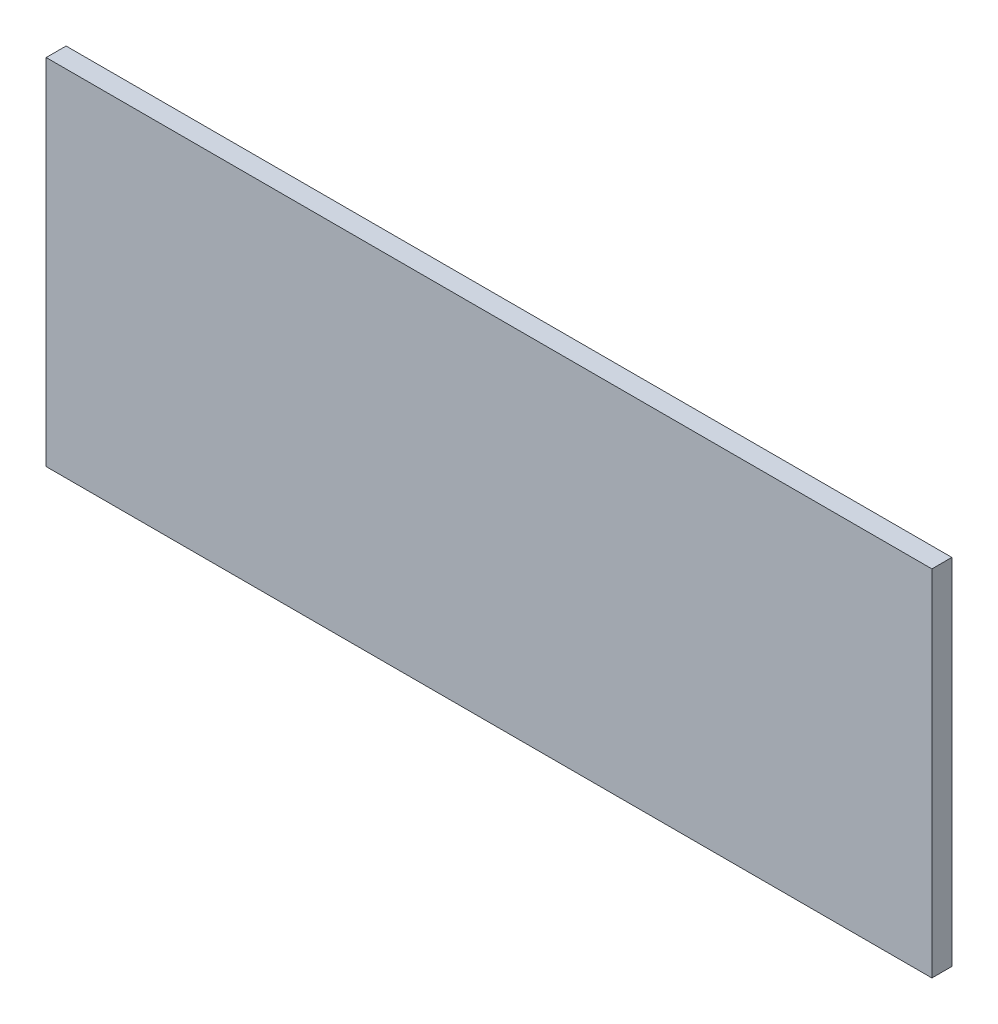
ISO-10303-21;
HEADER;
FILE_DESCRIPTION(('STEP AP214'),'2;1');
FILE_NAME('part.step','',(''),(''),'','','');
FILE_SCHEMA(('AUTOMOTIVE_DESIGN { 1 0 10303 214 1 1 1 1 }'));
ENDSEC;
DATA;
#1=APPLICATION_CONTEXT('core data for automotive mechanical design processes');
#2=APPLICATION_PROTOCOL_DEFINITION('international standard','automotive_design',2000,#1);
#3=PRODUCT_CONTEXT('',#1,'mechanical');
#4=PRODUCT('Part','Part','',(#3));
#5=PRODUCT_RELATED_PRODUCT_CATEGORY('part','',(#4));
#6=PRODUCT_DEFINITION_FORMATION('','',#4);
#7=PRODUCT_DEFINITION_CONTEXT('part definition',#1,'design');
#8=PRODUCT_DEFINITION('design','',#6,#7);
#9=PRODUCT_DEFINITION_SHAPE('','',#8);
#10=(LENGTH_UNIT() NAMED_UNIT(*) SI_UNIT(.MILLI.,.METRE.));
#11=(NAMED_UNIT(*) PLANE_ANGLE_UNIT() SI_UNIT($,.RADIAN.));
#12=(NAMED_UNIT(*) SI_UNIT($,.STERADIAN.) SOLID_ANGLE_UNIT());
#13=UNCERTAINTY_MEASURE_WITH_UNIT(LENGTH_MEASURE(1.E-05),#10,'distance_accuracy_value','');
#14=(GEOMETRIC_REPRESENTATION_CONTEXT(3) GLOBAL_UNCERTAINTY_ASSIGNED_CONTEXT((#13)) GLOBAL_UNIT_ASSIGNED_CONTEXT((#10,
#11,#12)) REPRESENTATION_CONTEXT('',''));
#15=CARTESIAN_POINT('',(0.,0.,0.));
#16=DIRECTION('',(0.,0.,1.));
#17=DIRECTION('',(1.,0.,0.));
#18=AXIS2_PLACEMENT_3D('',#15,#16,#17);
#19=CARTESIAN_POINT('',(-25.4,8.89,1.));
#20=DIRECTION('',(0.,0.,1.));
#21=DIRECTION('',(1.,0.,0.));
#22=AXIS2_PLACEMENT_3D('',#19,#20,#21);
#23=PLANE('',#22);
#24=DIRECTION('',(0.,1.,0.));
#25=VECTOR('',#24,1.);
#26=CARTESIAN_POINT('',(19.05,8.89,1.));
#27=LINE('',#26,#25);
#28=CARTESIAN_POINT('',(19.05,8.89,1.));
#29=VERTEX_POINT('',#28);
#30=CARTESIAN_POINT('',(19.05,-8.89,1.));
#31=VERTEX_POINT('',#30);
#32=EDGE_CURVE('E53',#29,#31,#27,.F.);
#33=ORIENTED_EDGE('',*,*,#32,.F.);
#34=DIRECTION('',(1.,0.,0.));
#35=VECTOR('',#34,1.);
#36=CARTESIAN_POINT('',(-25.4,8.89,1.));
#37=LINE('',#36,#35);
#38=CARTESIAN_POINT('',(-25.4,8.89,1.));
#39=VERTEX_POINT('',#38);
#40=EDGE_CURVE('E68',#39,#29,#37,.T.);
#41=ORIENTED_EDGE('',*,*,#40,.F.);
#42=DIRECTION('',(0.,1.,0.));
#43=VECTOR('',#42,1.);
#44=CARTESIAN_POINT('',(-25.4,-8.89,1.));
#45=LINE('',#44,#43);
#46=CARTESIAN_POINT('',(-25.4,-8.89,1.));
#47=VERTEX_POINT('',#46);
#48=EDGE_CURVE('E20',#47,#39,#45,.T.);
#49=ORIENTED_EDGE('',*,*,#48,.F.);
#50=DIRECTION('',(1.,0.,0.));
#51=VECTOR('',#50,1.);
#52=CARTESIAN_POINT('',(19.05,-8.89,1.));
#53=LINE('',#52,#51);
#54=EDGE_CURVE('E58',#31,#47,#53,.F.);
#55=ORIENTED_EDGE('',*,*,#54,.F.);
#56=EDGE_LOOP('',(#33,#41,#49,#55));
#57=FACE_BOUND('',#56,.T.);
#58=ADVANCED_FACE('F17',(#57),#23,.T.);
#59=CARTESIAN_POINT('',(-25.4,-8.89,0.));
#60=DIRECTION('',(-1.,0.,0.));
#61=DIRECTION('',(0.,0.,1.));
#62=AXIS2_PLACEMENT_3D('',#59,#60,#61);
#63=PLANE('',#62);
#64=DIRECTION('',(0.,0.,1.));
#65=VECTOR('',#64,1.);
#66=CARTESIAN_POINT('',(-25.4,8.89,0.));
#67=LINE('',#66,#65);
#68=CARTESIAN_POINT('',(-25.4,8.89,0.));
#69=VERTEX_POINT('',#68);
#70=EDGE_CURVE('E79',#69,#39,#67,.T.);
#71=ORIENTED_EDGE('',*,*,#70,.F.);
#72=DIRECTION('',(0.,1.,0.));
#73=VECTOR('',#72,1.);
#74=CARTESIAN_POINT('',(-25.4,8.89,0.));
#75=LINE('',#74,#73);
#76=CARTESIAN_POINT('',(-25.4,-8.89,0.));
#77=VERTEX_POINT('',#76);
#78=EDGE_CURVE('E74',#69,#77,#75,.F.);
#79=ORIENTED_EDGE('',*,*,#78,.T.);
#80=DIRECTION('',(0.,0.,-1.));
#81=VECTOR('',#80,1.);
#82=CARTESIAN_POINT('',(-25.4,-8.89,0.));
#83=LINE('',#82,#81);
#84=EDGE_CURVE('E63',#47,#77,#83,.T.);
#85=ORIENTED_EDGE('',*,*,#84,.F.);
#86=ORIENTED_EDGE('',*,*,#48,.T.);
#87=EDGE_LOOP('',(#71,#79,#85,#86));
#88=FACE_BOUND('',#87,.T.);
#89=ADVANCED_FACE('F73',(#88),#63,.T.);
#90=CARTESIAN_POINT('',(19.05,-8.89,0.));
#91=DIRECTION('',(0.,-1.,0.));
#92=DIRECTION('',(0.,0.,-1.));
#93=AXIS2_PLACEMENT_3D('',#90,#91,#92);
#94=PLANE('',#93);
#95=ORIENTED_EDGE('',*,*,#84,.T.);
#96=DIRECTION('',(1.,0.,0.));
#97=VECTOR('',#96,1.);
#98=CARTESIAN_POINT('',(-25.4,-8.89,0.));
#99=LINE('',#98,#97);
#100=CARTESIAN_POINT('',(19.05,-8.89,0.));
#101=VERTEX_POINT('',#100);
#102=EDGE_CURVE('E84',#77,#101,#99,.T.);
#103=ORIENTED_EDGE('',*,*,#102,.T.);
#104=DIRECTION('',(0.,0.,-1.));
#105=VECTOR('',#104,1.);
#106=CARTESIAN_POINT('',(19.05,-8.89,0.));
#107=LINE('',#106,#105);
#108=EDGE_CURVE('E65',#31,#101,#107,.T.);
#109=ORIENTED_EDGE('',*,*,#108,.F.);
#110=ORIENTED_EDGE('',*,*,#54,.T.);
#111=EDGE_LOOP('',(#95,#103,#109,#110));
#112=FACE_BOUND('',#111,.T.);
#113=ADVANCED_FACE('F60',(#112),#94,.T.);
#114=CARTESIAN_POINT('',(19.05,8.89,0.));
#115=DIRECTION('',(1.,0.,0.));
#116=DIRECTION('',(0.,0.,-1.));
#117=AXIS2_PLACEMENT_3D('',#114,#115,#116);
#118=PLANE('',#117);
#119=ORIENTED_EDGE('',*,*,#108,.T.);
#120=DIRECTION('',(0.,1.,0.));
#121=VECTOR('',#120,1.);
#122=CARTESIAN_POINT('',(19.05,8.89,0.));
#123=LINE('',#122,#121);
#124=CARTESIAN_POINT('',(19.05,8.89,0.));
#125=VERTEX_POINT('',#124);
#126=EDGE_CURVE('E26',#101,#125,#123,.T.);
#127=ORIENTED_EDGE('',*,*,#126,.T.);
#128=DIRECTION('',(0.,0.,1.));
#129=VECTOR('',#128,1.);
#130=CARTESIAN_POINT('',(19.05,8.89,0.));
#131=LINE('',#130,#129);
#132=EDGE_CURVE('E34',#29,#125,#131,.F.);
#133=ORIENTED_EDGE('',*,*,#132,.F.);
#134=ORIENTED_EDGE('',*,*,#32,.T.);
#135=EDGE_LOOP('',(#119,#127,#133,#134));
#136=FACE_BOUND('',#135,.T.);
#137=ADVANCED_FACE('F88',(#136),#118,.T.);
#138=CARTESIAN_POINT('',(-25.4,8.89,0.));
#139=DIRECTION('',(0.,1.,0.));
#140=DIRECTION('',(0.,0.,1.));
#141=AXIS2_PLACEMENT_3D('',#138,#139,#140);
#142=PLANE('',#141);
#143=ORIENTED_EDGE('',*,*,#132,.T.);
#144=DIRECTION('',(1.,0.,0.));
#145=VECTOR('',#144,1.);
#146=CARTESIAN_POINT('',(-25.4,8.89,0.));
#147=LINE('',#146,#145);
#148=EDGE_CURVE('E11',#125,#69,#147,.F.);
#149=ORIENTED_EDGE('',*,*,#148,.T.);
#150=ORIENTED_EDGE('',*,*,#70,.T.);
#151=ORIENTED_EDGE('',*,*,#40,.T.);
#152=EDGE_LOOP('',(#143,#149,#150,#151));
#153=FACE_BOUND('',#152,.T.);
#154=ADVANCED_FACE('F91',(#153),#142,.T.);
#155=CARTESIAN_POINT('',(-25.4,8.89,0.));
#156=DIRECTION('',(0.,0.,1.));
#157=DIRECTION('',(1.,0.,0.));
#158=AXIS2_PLACEMENT_3D('',#155,#156,#157);
#159=PLANE('',#158);
#160=ORIENTED_EDGE('',*,*,#126,.F.);
#161=ORIENTED_EDGE('',*,*,#102,.F.);
#162=ORIENTED_EDGE('',*,*,#78,.F.);
#163=ORIENTED_EDGE('',*,*,#148,.F.);
#164=EDGE_LOOP('',(#160,#161,#162,#163));
#165=FACE_BOUND('',#164,.T.);
#166=ADVANCED_FACE('F90',(#165),#159,.F.);
#167=CLOSED_SHELL('',(#58,#89,#113,#137,#154,#166));
#168=MANIFOLD_SOLID_BREP('B1',#167);
#169=ADVANCED_BREP_SHAPE_REPRESENTATION('',(#18,#168),#14);
#170=SHAPE_DEFINITION_REPRESENTATION(#9,#169);
ENDSEC;
END-ISO-10303-21;
